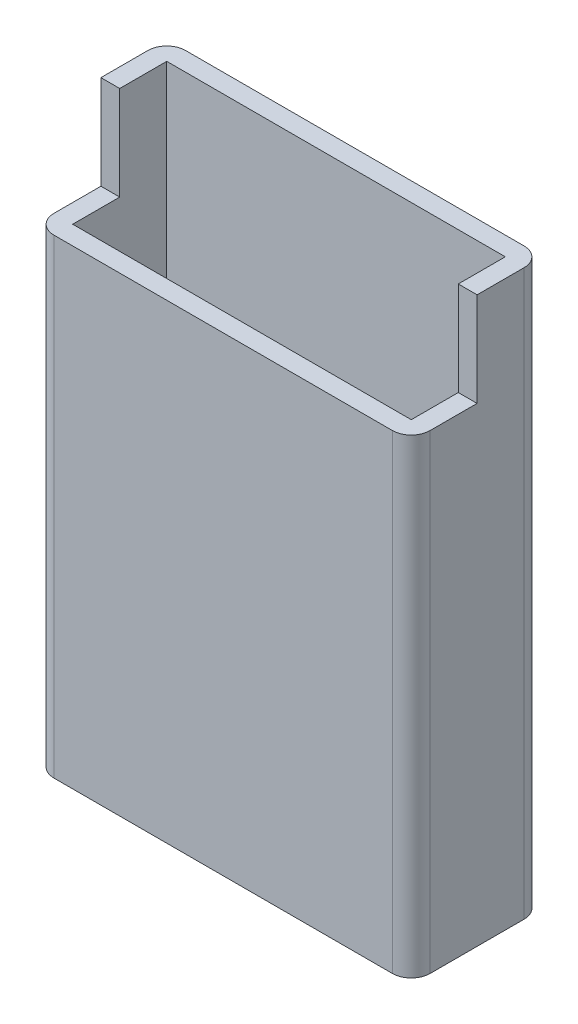
ISO-10303-21;
HEADER;
FILE_DESCRIPTION(('STEP AP214'),'2;1');
FILE_NAME('part.step','',(''),(''),'','','');
FILE_SCHEMA(('AUTOMOTIVE_DESIGN { 1 0 10303 214 1 1 1 1 }'));
ENDSEC;
DATA;
#1=APPLICATION_CONTEXT('core data for automotive mechanical design processes');
#2=APPLICATION_PROTOCOL_DEFINITION('international standard','automotive_design',2000,#1);
#3=PRODUCT_CONTEXT('',#1,'mechanical');
#4=PRODUCT('Part','Part','',(#3));
#5=PRODUCT_RELATED_PRODUCT_CATEGORY('part','',(#4));
#6=PRODUCT_DEFINITION_FORMATION('','',#4);
#7=PRODUCT_DEFINITION_CONTEXT('part definition',#1,'design');
#8=PRODUCT_DEFINITION('design','',#6,#7);
#9=PRODUCT_DEFINITION_SHAPE('','',#8);
#10=(LENGTH_UNIT() NAMED_UNIT(*) SI_UNIT(.MILLI.,.METRE.));
#11=(NAMED_UNIT(*) PLANE_ANGLE_UNIT() SI_UNIT($,.RADIAN.));
#12=(NAMED_UNIT(*) SI_UNIT($,.STERADIAN.) SOLID_ANGLE_UNIT());
#13=UNCERTAINTY_MEASURE_WITH_UNIT(LENGTH_MEASURE(1.E-05),#10,'distance_accuracy_value','');
#14=(GEOMETRIC_REPRESENTATION_CONTEXT(3) GLOBAL_UNCERTAINTY_ASSIGNED_CONTEXT((#13)) GLOBAL_UNIT_ASSIGNED_CONTEXT((#10,
#11,#12)) REPRESENTATION_CONTEXT('',''));
#15=CARTESIAN_POINT('',(0.,0.,0.));
#16=DIRECTION('',(0.,0.,1.));
#17=DIRECTION('',(1.,0.,0.));
#18=AXIS2_PLACEMENT_3D('',#15,#16,#17);
#19=CARTESIAN_POINT('',(0.,60.,0.));
#20=DIRECTION('',(0.,1.,0.));
#21=DIRECTION('',(0.,0.,1.));
#22=AXIS2_PLACEMENT_3D('',#19,#20,#21);
#23=PLANE('',#22);
#24=DIRECTION('',(0.,0.,1.));
#25=VECTOR('',#24,1.);
#26=CARTESIAN_POINT('',(40.,60.,-14.));
#27=LINE('',#26,#25);
#28=CARTESIAN_POINT('',(40.,60.,-12.));
#29=VERTEX_POINT('',#28);
#30=CARTESIAN_POINT('',(40.,60.,-7.));
#31=VERTEX_POINT('',#30);
#32=EDGE_CURVE('E162',#29,#31,#27,.T.);
#33=ORIENTED_EDGE('',*,*,#32,.F.);
#34=CARTESIAN_POINT('',(38.,60.,-12.));
#35=DIRECTION('',(0.,-1.,0.));
#36=DIRECTION('',(0.,0.,-1.));
#37=AXIS2_PLACEMENT_3D('',#34,#35,#36);
#38=CIRCLE('',#37,2.);
#39=CARTESIAN_POINT('',(38.,60.,-14.));
#40=VERTEX_POINT('',#39);
#41=EDGE_CURVE('E147',#40,#29,#38,.T.);
#42=ORIENTED_EDGE('',*,*,#41,.F.);
#43=DIRECTION('',(1.,0.,0.));
#44=VECTOR('',#43,1.);
#45=CARTESIAN_POINT('',(0.,60.,-14.));
#46=LINE('',#45,#44);
#47=CARTESIAN_POINT('',(2.00000000000001,60.,-14.));
#48=VERTEX_POINT('',#47);
#49=EDGE_CURVE('E172',#48,#40,#46,.T.);
#50=ORIENTED_EDGE('',*,*,#49,.F.);
#51=CARTESIAN_POINT('',(2.,60.,-12.));
#52=DIRECTION('',(0.,-1.,0.));
#53=DIRECTION('',(0.,0.,1.));
#54=AXIS2_PLACEMENT_3D('',#51,#52,#53);
#55=CIRCLE('',#54,2.);
#56=CARTESIAN_POINT('',(0.,60.,-12.));
#57=VERTEX_POINT('',#56);
#58=EDGE_CURVE('E155',#57,#48,#55,.T.);
#59=ORIENTED_EDGE('',*,*,#58,.F.);
#60=DIRECTION('',(0.,0.,1.));
#61=VECTOR('',#60,1.);
#62=CARTESIAN_POINT('',(0.,60.,-14.));
#63=LINE('',#62,#61);
#64=CARTESIAN_POINT('',(0.,60.,-7.));
#65=VERTEX_POINT('',#64);
#66=EDGE_CURVE('E173',#57,#65,#63,.T.);
#67=ORIENTED_EDGE('',*,*,#66,.T.);
#68=DIRECTION('',(-1.,0.,0.));
#69=VECTOR('',#68,1.);
#70=CARTESIAN_POINT('',(0.,60.,-7.));
#71=LINE('',#70,#69);
#72=CARTESIAN_POINT('',(2.,60.,-7.));
#73=VERTEX_POINT('',#72);
#74=EDGE_CURVE('E275',#73,#65,#71,.T.);
#75=ORIENTED_EDGE('',*,*,#74,.F.);
#76=DIRECTION('',(0.,0.,-1.));
#77=VECTOR('',#76,1.);
#78=CARTESIAN_POINT('',(2.,60.,-2.));
#79=LINE('',#78,#77);
#80=CARTESIAN_POINT('',(2.,60.,-12.));
#81=VERTEX_POINT('',#80);
#82=EDGE_CURVE('E236',#73,#81,#79,.T.);
#83=ORIENTED_EDGE('',*,*,#82,.T.);
#84=DIRECTION('',(1.,0.,0.));
#85=VECTOR('',#84,1.);
#86=CARTESIAN_POINT('',(2.,60.,-12.));
#87=LINE('',#86,#85);
#88=CARTESIAN_POINT('',(38.,60.,-12.));
#89=VERTEX_POINT('',#88);
#90=EDGE_CURVE('E251',#81,#89,#87,.T.);
#91=ORIENTED_EDGE('',*,*,#90,.T.);
#92=DIRECTION('',(0.,0.,-1.));
#93=VECTOR('',#92,1.);
#94=CARTESIAN_POINT('',(38.,60.,-2.));
#95=LINE('',#94,#93);
#96=CARTESIAN_POINT('',(38.,60.,-7.));
#97=VERTEX_POINT('',#96);
#98=EDGE_CURVE('E241',#97,#89,#95,.T.);
#99=ORIENTED_EDGE('',*,*,#98,.F.);
#100=EDGE_CURVE('E171',#31,#97,#71,.T.);
#101=ORIENTED_EDGE('',*,*,#100,.F.);
#102=EDGE_LOOP('',(#33,#42,#50,#59,#67,#75,#83,#91,#99,#101));
#103=FACE_BOUND('',#102,.T.);
#104=ADVANCED_FACE('F37',(#103),#23,.T.);
#105=CARTESIAN_POINT('',(0.,60.,-14.));
#106=DIRECTION('',(1.,0.,0.));
#107=DIRECTION('',(0.,0.,-1.));
#108=AXIS2_PLACEMENT_3D('',#105,#106,#107);
#109=PLANE('',#108);
#110=ORIENTED_EDGE('',*,*,#66,.F.);
#111=DIRECTION('',(0.,-1.,0.));
#112=VECTOR('',#111,1.);
#113=CARTESIAN_POINT('',(0.,60.,-12.));
#114=LINE('',#113,#112);
#115=CARTESIAN_POINT('',(0.,0.,-12.));
#116=VERTEX_POINT('',#115);
#117=EDGE_CURVE('E290',#57,#116,#114,.T.);
#118=ORIENTED_EDGE('',*,*,#117,.T.);
#119=DIRECTION('',(0.,0.,1.));
#120=VECTOR('',#119,1.);
#121=CARTESIAN_POINT('',(0.,0.,-14.));
#122=LINE('',#121,#120);
#123=CARTESIAN_POINT('',(0.,0.,-2.00000000000001));
#124=VERTEX_POINT('',#123);
#125=EDGE_CURVE('E181',#116,#124,#122,.T.);
#126=ORIENTED_EDGE('',*,*,#125,.T.);
#127=DIRECTION('',(0.,-1.,0.));
#128=VECTOR('',#127,1.);
#129=CARTESIAN_POINT('',(0.,60.,-2.00000000000001));
#130=LINE('',#129,#128);
#131=CARTESIAN_POINT('',(0.,50.,-2.00000000000001));
#132=VERTEX_POINT('',#131);
#133=EDGE_CURVE('E288',#132,#124,#130,.T.);
#134=ORIENTED_EDGE('',*,*,#133,.F.);
#135=DIRECTION('',(0.,0.,1.));
#136=VECTOR('',#135,1.);
#137=CARTESIAN_POINT('',(0.,50.,-7.));
#138=LINE('',#137,#136);
#139=CARTESIAN_POINT('',(0.,50.,-7.));
#140=VERTEX_POINT('',#139);
#141=EDGE_CURVE('E227',#140,#132,#138,.T.);
#142=ORIENTED_EDGE('',*,*,#141,.F.);
#143=DIRECTION('',(0.,-1.,0.));
#144=VECTOR('',#143,1.);
#145=CARTESIAN_POINT('',(0.,60.,-7.));
#146=LINE('',#145,#144);
#147=EDGE_CURVE('E215',#65,#140,#146,.T.);
#148=ORIENTED_EDGE('',*,*,#147,.F.);
#149=EDGE_LOOP('',(#110,#118,#126,#134,#142,#148));
#150=FACE_BOUND('',#149,.T.);
#151=ADVANCED_FACE('F39',(#150),#109,.F.);
#152=CARTESIAN_POINT('',(0.,60.,0.));
#153=DIRECTION('',(0.,0.,-1.));
#154=DIRECTION('',(-1.,0.,0.));
#155=AXIS2_PLACEMENT_3D('',#152,#153,#154);
#156=PLANE('',#155);
#157=DIRECTION('',(1.,0.,0.));
#158=VECTOR('',#157,1.);
#159=CARTESIAN_POINT('',(0.,50.,0.));
#160=LINE('',#159,#158);
#161=CARTESIAN_POINT('',(2.00000000000001,50.,0.));
#162=VERTEX_POINT('',#161);
#163=CARTESIAN_POINT('',(38.,50.,0.));
#164=VERTEX_POINT('',#163);
#165=EDGE_CURVE('E208',#162,#164,#160,.T.);
#166=ORIENTED_EDGE('',*,*,#165,.F.);
#167=DIRECTION('',(0.,-1.,0.));
#168=VECTOR('',#167,1.);
#169=CARTESIAN_POINT('',(2.00000000000001,60.,0.));
#170=LINE('',#169,#168);
#171=CARTESIAN_POINT('',(2.00000000000001,0.,0.));
#172=VERTEX_POINT('',#171);
#173=EDGE_CURVE('E210',#162,#172,#170,.T.);
#174=ORIENTED_EDGE('',*,*,#173,.T.);
#175=DIRECTION('',(1.,0.,0.));
#176=VECTOR('',#175,1.);
#177=CARTESIAN_POINT('',(0.,0.,0.));
#178=LINE('',#177,#176);
#179=CARTESIAN_POINT('',(38.,0.,0.));
#180=VERTEX_POINT('',#179);
#181=EDGE_CURVE('E184',#172,#180,#178,.T.);
#182=ORIENTED_EDGE('',*,*,#181,.T.);
#183=DIRECTION('',(0.,-1.,0.));
#184=VECTOR('',#183,1.);
#185=CARTESIAN_POINT('',(38.,60.,0.));
#186=LINE('',#185,#184);
#187=EDGE_CURVE('E198',#164,#180,#186,.T.);
#188=ORIENTED_EDGE('',*,*,#187,.F.);
#189=EDGE_LOOP('',(#166,#174,#182,#188));
#190=FACE_BOUND('',#189,.T.);
#191=ADVANCED_FACE('F206',(#190),#156,.F.);
#192=CARTESIAN_POINT('',(40.,60.,-14.));
#193=DIRECTION('',(1.,0.,0.));
#194=DIRECTION('',(0.,0.,-1.));
#195=AXIS2_PLACEMENT_3D('',#192,#193,#194);
#196=PLANE('',#195);
#197=DIRECTION('',(0.,-1.,0.));
#198=VECTOR('',#197,1.);
#199=CARTESIAN_POINT('',(40.,60.,-12.));
#200=LINE('',#199,#198);
#201=CARTESIAN_POINT('',(40.,0.,-12.));
#202=VERTEX_POINT('',#201);
#203=EDGE_CURVE('E52',#29,#202,#200,.T.);
#204=ORIENTED_EDGE('',*,*,#203,.F.);
#205=ORIENTED_EDGE('',*,*,#32,.T.);
#206=DIRECTION('',(0.,1.,0.));
#207=VECTOR('',#206,1.);
#208=CARTESIAN_POINT('',(40.,60.,-7.));
#209=LINE('',#208,#207);
#210=CARTESIAN_POINT('',(40.,50.,-7.));
#211=VERTEX_POINT('',#210);
#212=EDGE_CURVE('E280',#211,#31,#209,.T.);
#213=ORIENTED_EDGE('',*,*,#212,.F.);
#214=DIRECTION('',(0.,0.,1.));
#215=VECTOR('',#214,1.);
#216=CARTESIAN_POINT('',(40.,50.,-7.));
#217=LINE('',#216,#215);
#218=CARTESIAN_POINT('',(40.,50.,-2.00000000000001));
#219=VERTEX_POINT('',#218);
#220=EDGE_CURVE('E224',#211,#219,#217,.T.);
#221=ORIENTED_EDGE('',*,*,#220,.T.);
#222=DIRECTION('',(0.,-1.,0.));
#223=VECTOR('',#222,1.);
#224=CARTESIAN_POINT('',(40.,60.,-2.00000000000001));
#225=LINE('',#224,#223);
#226=CARTESIAN_POINT('',(40.,0.,-2.00000000000001));
#227=VERTEX_POINT('',#226);
#228=EDGE_CURVE('E167',#219,#227,#225,.T.);
#229=ORIENTED_EDGE('',*,*,#228,.T.);
#230=DIRECTION('',(0.,0.,1.));
#231=VECTOR('',#230,1.);
#232=CARTESIAN_POINT('',(40.,0.,-14.));
#233=LINE('',#232,#231);
#234=EDGE_CURVE('E166',#202,#227,#233,.T.);
#235=ORIENTED_EDGE('',*,*,#234,.F.);
#236=EDGE_LOOP('',(#204,#205,#213,#221,#229,#235));
#237=FACE_BOUND('',#236,.T.);
#238=ADVANCED_FACE('F160',(#237),#196,.T.);
#239=CARTESIAN_POINT('',(0.,60.,-14.));
#240=DIRECTION('',(0.,0.,-1.));
#241=DIRECTION('',(-1.,0.,0.));
#242=AXIS2_PLACEMENT_3D('',#239,#240,#241);
#243=PLANE('',#242);
#244=ORIENTED_EDGE('',*,*,#49,.T.);
#245=DIRECTION('',(0.,-1.,0.));
#246=VECTOR('',#245,1.);
#247=CARTESIAN_POINT('',(38.,60.,-14.));
#248=LINE('',#247,#246);
#249=CARTESIAN_POINT('',(38.,0.,-14.));
#250=VERTEX_POINT('',#249);
#251=EDGE_CURVE('E150',#40,#250,#248,.T.);
#252=ORIENTED_EDGE('',*,*,#251,.T.);
#253=DIRECTION('',(1.,0.,0.));
#254=VECTOR('',#253,1.);
#255=CARTESIAN_POINT('',(0.,0.,-14.));
#256=LINE('',#255,#254);
#257=CARTESIAN_POINT('',(2.,0.,-14.));
#258=VERTEX_POINT('',#257);
#259=EDGE_CURVE('E177',#258,#250,#256,.T.);
#260=ORIENTED_EDGE('',*,*,#259,.F.);
#261=DIRECTION('',(0.,-1.,0.));
#262=VECTOR('',#261,1.);
#263=CARTESIAN_POINT('',(2.00000000000001,60.,-14.));
#264=LINE('',#263,#262);
#265=EDGE_CURVE('E60',#48,#258,#264,.T.);
#266=ORIENTED_EDGE('',*,*,#265,.F.);
#267=EDGE_LOOP('',(#244,#252,#260,#266));
#268=FACE_BOUND('',#267,.T.);
#269=ADVANCED_FACE('F305',(#268),#243,.T.);
#270=CARTESIAN_POINT('',(0.,0.,0.));
#271=DIRECTION('',(0.,1.,0.));
#272=DIRECTION('',(0.,0.,1.));
#273=AXIS2_PLACEMENT_3D('',#270,#271,#272);
#274=PLANE('',#273);
#275=CARTESIAN_POINT('',(38.,0.,-12.));
#276=DIRECTION('',(0.,-1.,0.));
#277=DIRECTION('',(0.,0.,-1.));
#278=AXIS2_PLACEMENT_3D('',#275,#276,#277);
#279=CIRCLE('',#278,2.);
#280=EDGE_CURVE('E300',#250,#202,#279,.T.);
#281=ORIENTED_EDGE('',*,*,#280,.T.);
#282=ORIENTED_EDGE('',*,*,#234,.T.);
#283=CARTESIAN_POINT('',(38.,0.,-2.));
#284=DIRECTION('',(0.,-1.,0.));
#285=DIRECTION('',(0.,0.,1.));
#286=AXIS2_PLACEMENT_3D('',#283,#284,#285);
#287=CIRCLE('',#286,2.);
#288=EDGE_CURVE('E298',#227,#180,#287,.T.);
#289=ORIENTED_EDGE('',*,*,#288,.T.);
#290=ORIENTED_EDGE('',*,*,#181,.F.);
#291=CARTESIAN_POINT('',(2.,0.,-2.));
#292=DIRECTION('',(0.,-1.,0.));
#293=DIRECTION('',(0.,0.,1.));
#294=AXIS2_PLACEMENT_3D('',#291,#292,#293);
#295=CIRCLE('',#294,2.);
#296=EDGE_CURVE('E295',#172,#124,#295,.T.);
#297=ORIENTED_EDGE('',*,*,#296,.T.);
#298=ORIENTED_EDGE('',*,*,#125,.F.);
#299=CARTESIAN_POINT('',(2.,0.,-12.));
#300=DIRECTION('',(0.,-1.,0.));
#301=DIRECTION('',(0.,0.,1.));
#302=AXIS2_PLACEMENT_3D('',#299,#300,#301);
#303=CIRCLE('',#302,2.);
#304=EDGE_CURVE('E156',#116,#258,#303,.T.);
#305=ORIENTED_EDGE('',*,*,#304,.T.);
#306=ORIENTED_EDGE('',*,*,#259,.T.);
#307=EDGE_LOOP('',(#281,#282,#289,#290,#297,#298,#305,#306));
#308=FACE_BOUND('',#307,.T.);
#309=ADVANCED_FACE('F307',(#308),#274,.F.);
#310=CARTESIAN_POINT('',(0.,50.,-7.));
#311=DIRECTION('',(0.,-1.,0.));
#312=DIRECTION('',(0.,0.,-1.));
#313=AXIS2_PLACEMENT_3D('',#310,#311,#312);
#314=PLANE('',#313);
#315=CARTESIAN_POINT('',(2.,50.,-2.));
#316=DIRECTION('',(0.,-1.,0.));
#317=DIRECTION('',(0.,0.,-1.));
#318=AXIS2_PLACEMENT_3D('',#315,#316,#317);
#319=CIRCLE('',#318,2.);
#320=EDGE_CURVE('E12',#162,#132,#319,.T.);
#321=ORIENTED_EDGE('',*,*,#320,.F.);
#322=ORIENTED_EDGE('',*,*,#165,.T.);
#323=CARTESIAN_POINT('',(38.,50.,-2.));
#324=DIRECTION('',(0.,-1.,0.));
#325=DIRECTION('',(0.,0.,-1.));
#326=AXIS2_PLACEMENT_3D('',#323,#324,#325);
#327=CIRCLE('',#326,2.);
#328=EDGE_CURVE('E45',#219,#164,#327,.T.);
#329=ORIENTED_EDGE('',*,*,#328,.F.);
#330=ORIENTED_EDGE('',*,*,#220,.F.);
#331=DIRECTION('',(1.,0.,0.));
#332=VECTOR('',#331,1.);
#333=CARTESIAN_POINT('',(0.,50.,-7.));
#334=LINE('',#333,#332);
#335=CARTESIAN_POINT('',(38.,50.,-7.));
#336=VERTEX_POINT('',#335);
#337=EDGE_CURVE('E218',#336,#211,#334,.T.);
#338=ORIENTED_EDGE('',*,*,#337,.F.);
#339=DIRECTION('',(0.,0.,-1.));
#340=VECTOR('',#339,1.);
#341=CARTESIAN_POINT('',(38.,50.,-2.));
#342=LINE('',#341,#340);
#343=CARTESIAN_POINT('',(38.,50.,-2.));
#344=VERTEX_POINT('',#343);
#345=EDGE_CURVE('E226',#344,#336,#342,.T.);
#346=ORIENTED_EDGE('',*,*,#345,.F.);
#347=DIRECTION('',(1.,0.,0.));
#348=VECTOR('',#347,1.);
#349=CARTESIAN_POINT('',(2.,50.,-2.));
#350=LINE('',#349,#348);
#351=CARTESIAN_POINT('',(2.,50.,-2.));
#352=VERTEX_POINT('',#351);
#353=EDGE_CURVE('E175',#352,#344,#350,.T.);
#354=ORIENTED_EDGE('',*,*,#353,.F.);
#355=DIRECTION('',(0.,0.,-1.));
#356=VECTOR('',#355,1.);
#357=CARTESIAN_POINT('',(2.,50.,-2.));
#358=LINE('',#357,#356);
#359=CARTESIAN_POINT('',(2.,50.,-7.));
#360=VERTEX_POINT('',#359);
#361=EDGE_CURVE('E231',#352,#360,#358,.T.);
#362=ORIENTED_EDGE('',*,*,#361,.T.);
#363=EDGE_CURVE('E281',#140,#360,#334,.T.);
#364=ORIENTED_EDGE('',*,*,#363,.F.);
#365=ORIENTED_EDGE('',*,*,#141,.T.);
#366=EDGE_LOOP('',(#321,#322,#329,#330,#338,#346,#354,#362,#364,#365));
#367=FACE_BOUND('',#366,.T.);
#368=ADVANCED_FACE('F213',(#367),#314,.F.);
#369=CARTESIAN_POINT('',(2.,5.,-2.));
#370=DIRECTION('',(1.,0.,0.));
#371=DIRECTION('',(0.,0.,-1.));
#372=AXIS2_PLACEMENT_3D('',#369,#370,#371);
#373=PLANE('',#372);
#374=ORIENTED_EDGE('',*,*,#361,.F.);
#375=DIRECTION('',(0.,1.,0.));
#376=VECTOR('',#375,1.);
#377=CARTESIAN_POINT('',(2.,5.,-2.));
#378=LINE('',#377,#376);
#379=CARTESIAN_POINT('',(2.,5.,-2.));
#380=VERTEX_POINT('',#379);
#381=EDGE_CURVE('E249',#380,#352,#378,.T.);
#382=ORIENTED_EDGE('',*,*,#381,.F.);
#383=DIRECTION('',(0.,0.,-1.));
#384=VECTOR('',#383,1.);
#385=CARTESIAN_POINT('',(2.,5.,-2.));
#386=LINE('',#385,#384);
#387=CARTESIAN_POINT('',(2.,5.,-12.));
#388=VERTEX_POINT('',#387);
#389=EDGE_CURVE('E237',#380,#388,#386,.T.);
#390=ORIENTED_EDGE('',*,*,#389,.T.);
#391=DIRECTION('',(0.,1.,0.));
#392=VECTOR('',#391,1.);
#393=CARTESIAN_POINT('',(2.,5.,-12.));
#394=LINE('',#393,#392);
#395=EDGE_CURVE('E185',#388,#81,#394,.T.);
#396=ORIENTED_EDGE('',*,*,#395,.T.);
#397=ORIENTED_EDGE('',*,*,#82,.F.);
#398=DIRECTION('',(0.,-1.,0.));
#399=VECTOR('',#398,1.);
#400=CARTESIAN_POINT('',(2.,5.,-7.));
#401=LINE('',#400,#399);
#402=EDGE_CURVE('E233',#73,#360,#401,.T.);
#403=ORIENTED_EDGE('',*,*,#402,.T.);
#404=EDGE_LOOP('',(#374,#382,#390,#396,#397,#403));
#405=FACE_BOUND('',#404,.T.);
#406=ADVANCED_FACE('F267',(#405),#373,.T.);
#407=CARTESIAN_POINT('',(2.,5.,-12.));
#408=DIRECTION('',(0.,0.,1.));
#409=DIRECTION('',(1.,0.,0.));
#410=AXIS2_PLACEMENT_3D('',#407,#408,#409);
#411=PLANE('',#410);
#412=ORIENTED_EDGE('',*,*,#90,.F.);
#413=ORIENTED_EDGE('',*,*,#395,.F.);
#414=DIRECTION('',(1.,0.,0.));
#415=VECTOR('',#414,1.);
#416=CARTESIAN_POINT('',(2.,5.,-12.));
#417=LINE('',#416,#415);
#418=CARTESIAN_POINT('',(38.,5.,-12.));
#419=VERTEX_POINT('',#418);
#420=EDGE_CURVE('E240',#388,#419,#417,.T.);
#421=ORIENTED_EDGE('',*,*,#420,.T.);
#422=DIRECTION('',(0.,1.,0.));
#423=VECTOR('',#422,1.);
#424=CARTESIAN_POINT('',(38.,5.,-12.));
#425=LINE('',#424,#423);
#426=EDGE_CURVE('E260',#419,#89,#425,.T.);
#427=ORIENTED_EDGE('',*,*,#426,.T.);
#428=EDGE_LOOP('',(#412,#413,#421,#427));
#429=FACE_BOUND('',#428,.T.);
#430=ADVANCED_FACE('F271',(#429),#411,.T.);
#431=CARTESIAN_POINT('',(38.,5.,-2.));
#432=DIRECTION('',(1.,0.,0.));
#433=DIRECTION('',(0.,0.,-1.));
#434=AXIS2_PLACEMENT_3D('',#431,#432,#433);
#435=PLANE('',#434);
#436=DIRECTION('',(0.,1.,0.));
#437=VECTOR('',#436,1.);
#438=CARTESIAN_POINT('',(38.,5.,-2.));
#439=LINE('',#438,#437);
#440=CARTESIAN_POINT('',(38.,5.,-2.));
#441=VERTEX_POINT('',#440);
#442=EDGE_CURVE('E257',#441,#344,#439,.T.);
#443=ORIENTED_EDGE('',*,*,#442,.T.);
#444=ORIENTED_EDGE('',*,*,#345,.T.);
#445=DIRECTION('',(0.,-1.,0.));
#446=VECTOR('',#445,1.);
#447=CARTESIAN_POINT('',(38.,5.,-7.));
#448=LINE('',#447,#446);
#449=EDGE_CURVE('E193',#97,#336,#448,.T.);
#450=ORIENTED_EDGE('',*,*,#449,.F.);
#451=ORIENTED_EDGE('',*,*,#98,.T.);
#452=ORIENTED_EDGE('',*,*,#426,.F.);
#453=DIRECTION('',(0.,0.,-1.));
#454=VECTOR('',#453,1.);
#455=CARTESIAN_POINT('',(38.,5.,-2.));
#456=LINE('',#455,#454);
#457=EDGE_CURVE('E243',#441,#419,#456,.T.);
#458=ORIENTED_EDGE('',*,*,#457,.F.);
#459=EDGE_LOOP('',(#443,#444,#450,#451,#452,#458));
#460=FACE_BOUND('',#459,.T.);
#461=ADVANCED_FACE('F320',(#460),#435,.F.);
#462=CARTESIAN_POINT('',(2.,5.,-2.));
#463=DIRECTION('',(0.,0.,1.));
#464=DIRECTION('',(1.,0.,0.));
#465=AXIS2_PLACEMENT_3D('',#462,#463,#464);
#466=PLANE('',#465);
#467=ORIENTED_EDGE('',*,*,#381,.T.);
#468=ORIENTED_EDGE('',*,*,#353,.T.);
#469=ORIENTED_EDGE('',*,*,#442,.F.);
#470=DIRECTION('',(1.,0.,0.));
#471=VECTOR('',#470,1.);
#472=CARTESIAN_POINT('',(2.,5.,-2.));
#473=LINE('',#472,#471);
#474=EDGE_CURVE('E246',#380,#441,#473,.T.);
#475=ORIENTED_EDGE('',*,*,#474,.F.);
#476=EDGE_LOOP('',(#467,#468,#469,#475));
#477=FACE_BOUND('',#476,.T.);
#478=ADVANCED_FACE('F315',(#477),#466,.F.);
#479=CARTESIAN_POINT('',(0.,5.,0.));
#480=DIRECTION('',(0.,-1.,0.));
#481=DIRECTION('',(0.,0.,-1.));
#482=AXIS2_PLACEMENT_3D('',#479,#480,#481);
#483=PLANE('',#482);
#484=ORIENTED_EDGE('',*,*,#389,.F.);
#485=ORIENTED_EDGE('',*,*,#474,.T.);
#486=ORIENTED_EDGE('',*,*,#457,.T.);
#487=ORIENTED_EDGE('',*,*,#420,.F.);
#488=EDGE_LOOP('',(#484,#485,#486,#487));
#489=FACE_BOUND('',#488,.T.);
#490=ADVANCED_FACE('F318',(#489),#483,.F.);
#491=CARTESIAN_POINT('',(0.,0.,-7.));
#492=DIRECTION('',(0.,0.,1.));
#493=DIRECTION('',(1.,0.,0.));
#494=AXIS2_PLACEMENT_3D('',#491,#492,#493);
#495=PLANE('',#494);
#496=ORIENTED_EDGE('',*,*,#449,.T.);
#497=ORIENTED_EDGE('',*,*,#337,.T.);
#498=ORIENTED_EDGE('',*,*,#212,.T.);
#499=ORIENTED_EDGE('',*,*,#100,.T.);
#500=EDGE_LOOP('',(#496,#497,#498,#499));
#501=FACE_BOUND('',#500,.T.);
#502=ADVANCED_FACE('F323',(#501),#495,.T.);
#503=ORIENTED_EDGE('',*,*,#74,.T.);
#504=ORIENTED_EDGE('',*,*,#147,.T.);
#505=ORIENTED_EDGE('',*,*,#363,.T.);
#506=ORIENTED_EDGE('',*,*,#402,.F.);
#507=EDGE_LOOP('',(#503,#504,#505,#506));
#508=FACE_BOUND('',#507,.T.);
#509=ADVANCED_FACE('F312',(#508),#495,.T.);
#510=CARTESIAN_POINT('',(38.,60.,-2.));
#511=DIRECTION('',(0.,-1.,0.));
#512=DIRECTION('',(0.,0.,-1.));
#513=AXIS2_PLACEMENT_3D('',#510,#511,#512);
#514=CYLINDRICAL_SURFACE('',#513,2.);
#515=ORIENTED_EDGE('',*,*,#328,.T.);
#516=ORIENTED_EDGE('',*,*,#187,.T.);
#517=ORIENTED_EDGE('',*,*,#288,.F.);
#518=ORIENTED_EDGE('',*,*,#228,.F.);
#519=EDGE_LOOP('',(#515,#516,#517,#518));
#520=FACE_BOUND('',#519,.T.);
#521=ADVANCED_FACE('F197',(#520),#514,.T.);
#522=CARTESIAN_POINT('',(2.,60.,-2.));
#523=DIRECTION('',(0.,-1.,0.));
#524=DIRECTION('',(0.,0.,-1.));
#525=AXIS2_PLACEMENT_3D('',#522,#523,#524);
#526=CYLINDRICAL_SURFACE('',#525,2.);
#527=ORIENTED_EDGE('',*,*,#320,.T.);
#528=ORIENTED_EDGE('',*,*,#133,.T.);
#529=ORIENTED_EDGE('',*,*,#296,.F.);
#530=ORIENTED_EDGE('',*,*,#173,.F.);
#531=EDGE_LOOP('',(#527,#528,#529,#530));
#532=FACE_BOUND('',#531,.T.);
#533=ADVANCED_FACE('F325',(#532),#526,.T.);
#534=CARTESIAN_POINT('',(2.,60.,-12.));
#535=DIRECTION('',(0.,-1.,0.));
#536=DIRECTION('',(0.,0.,-1.));
#537=AXIS2_PLACEMENT_3D('',#534,#535,#536);
#538=CYLINDRICAL_SURFACE('',#537,2.);
#539=ORIENTED_EDGE('',*,*,#304,.F.);
#540=ORIENTED_EDGE('',*,*,#117,.F.);
#541=ORIENTED_EDGE('',*,*,#58,.T.);
#542=ORIENTED_EDGE('',*,*,#265,.T.);
#543=EDGE_LOOP('',(#539,#540,#541,#542));
#544=FACE_BOUND('',#543,.T.);
#545=ADVANCED_FACE('F302',(#544),#538,.T.);
#546=CARTESIAN_POINT('',(38.,60.,-12.));
#547=DIRECTION('',(0.,-1.,0.));
#548=DIRECTION('',(0.,0.,-1.));
#549=AXIS2_PLACEMENT_3D('',#546,#547,#548);
#550=CYLINDRICAL_SURFACE('',#549,2.);
#551=ORIENTED_EDGE('',*,*,#280,.F.);
#552=ORIENTED_EDGE('',*,*,#251,.F.);
#553=ORIENTED_EDGE('',*,*,#41,.T.);
#554=ORIENTED_EDGE('',*,*,#203,.T.);
#555=EDGE_LOOP('',(#551,#552,#553,#554));
#556=FACE_BOUND('',#555,.T.);
#557=ADVANCED_FACE('F148',(#556),#550,.T.);
#558=CLOSED_SHELL('',(#104,#151,#191,#238,#269,#309,#368,#406,#430,#461,#478,#490,#502,#509,
#521,#533,#545,#557));
#559=MANIFOLD_SOLID_BREP('B2',#558);
#560=ADVANCED_BREP_SHAPE_REPRESENTATION('',(#18,#559),#14);
#561=SHAPE_DEFINITION_REPRESENTATION(#9,#560);
ENDSEC;
END-ISO-10303-21;
